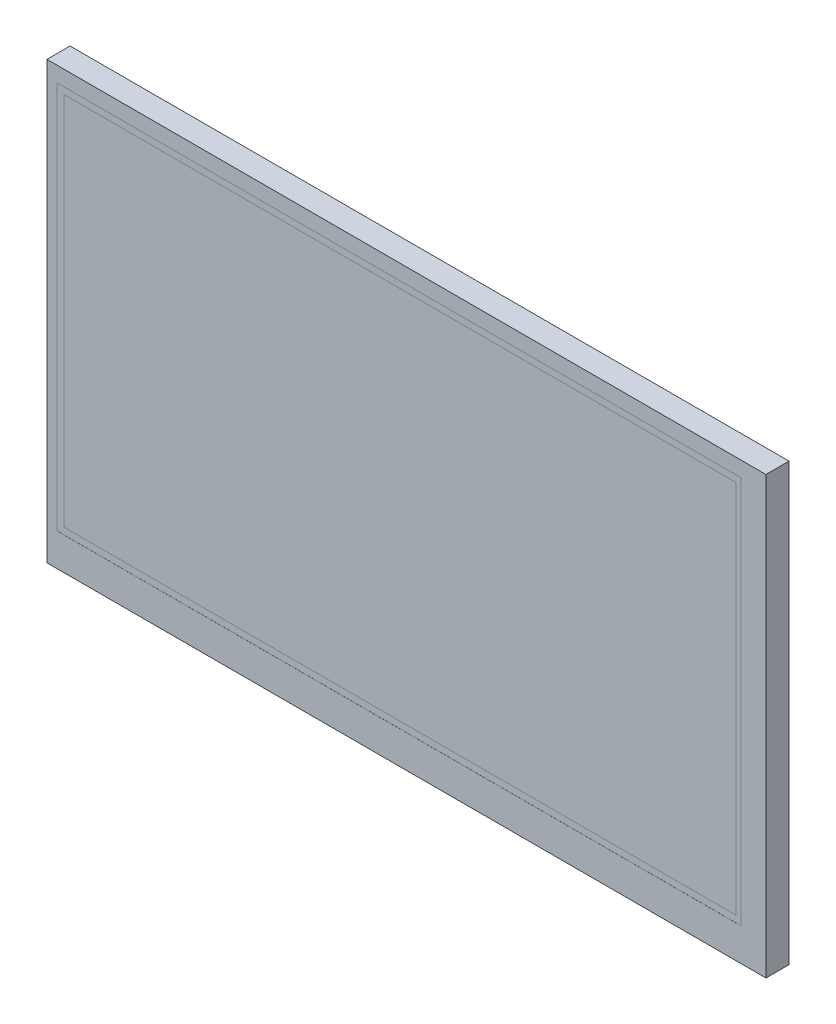
ISO-10303-21;
HEADER;
FILE_DESCRIPTION(('STEP AP214'),'2;1');
FILE_NAME('part.step','',(''),(''),'','','');
FILE_SCHEMA(('AUTOMOTIVE_DESIGN { 1 0 10303 214 1 1 1 1 }'));
ENDSEC;
DATA;
#1=APPLICATION_CONTEXT('core data for automotive mechanical design processes');
#2=APPLICATION_PROTOCOL_DEFINITION('international standard','automotive_design',2000,#1);
#3=PRODUCT_CONTEXT('',#1,'mechanical');
#4=PRODUCT('Part','Part','',(#3));
#5=PRODUCT_RELATED_PRODUCT_CATEGORY('part','',(#4));
#6=PRODUCT_DEFINITION_FORMATION('','',#4);
#7=PRODUCT_DEFINITION_CONTEXT('part definition',#1,'design');
#8=PRODUCT_DEFINITION('design','',#6,#7);
#9=PRODUCT_DEFINITION_SHAPE('','',#8);
#10=(LENGTH_UNIT() NAMED_UNIT(*) SI_UNIT(.MILLI.,.METRE.));
#11=(NAMED_UNIT(*) PLANE_ANGLE_UNIT() SI_UNIT($,.RADIAN.));
#12=(NAMED_UNIT(*) SI_UNIT($,.STERADIAN.) SOLID_ANGLE_UNIT());
#13=UNCERTAINTY_MEASURE_WITH_UNIT(LENGTH_MEASURE(1.E-05),#10,'distance_accuracy_value','');
#14=(GEOMETRIC_REPRESENTATION_CONTEXT(3) GLOBAL_UNCERTAINTY_ASSIGNED_CONTEXT((#13)) GLOBAL_UNIT_ASSIGNED_CONTEXT((#10,
#11,#12)) REPRESENTATION_CONTEXT('',''));
#15=CARTESIAN_POINT('',(0.,0.,0.));
#16=DIRECTION('',(0.,0.,1.));
#17=DIRECTION('',(1.,0.,0.));
#18=AXIS2_PLACEMENT_3D('',#15,#16,#17);
#19=CARTESIAN_POINT('',(0.,0.,5.29));
#20=DIRECTION('',(0.,0.,1.));
#21=DIRECTION('',(1.,0.,0.));
#22=AXIS2_PLACEMENT_3D('',#19,#20,#21);
#23=PLANE('',#22);
#24=DIRECTION('',(0.,-1.,0.));
#25=VECTOR('',#24,1.);
#26=CARTESIAN_POINT('',(-80.15,-42.5,5.29));
#27=LINE('',#26,#25);
#28=CARTESIAN_POINT('',(-80.15,46.5,5.29));
#29=VERTEX_POINT('',#28);
#30=CARTESIAN_POINT('',(-80.15,-42.5,5.29));
#31=VERTEX_POINT('',#30);
#32=EDGE_CURVE('E164',#29,#31,#27,.T.);
#33=ORIENTED_EDGE('',*,*,#32,.T.);
#34=DIRECTION('',(1.,0.,0.));
#35=VECTOR('',#34,1.);
#36=CARTESIAN_POINT('',(76.7500000000001,-42.5,5.29));
#37=LINE('',#36,#35);
#38=CARTESIAN_POINT('',(76.7500000000001,-42.5,5.29));
#39=VERTEX_POINT('',#38);
#40=EDGE_CURVE('E168',#31,#39,#37,.T.);
#41=ORIENTED_EDGE('',*,*,#40,.T.);
#42=DIRECTION('',(0.,1.,0.));
#43=VECTOR('',#42,1.);
#44=CARTESIAN_POINT('',(76.7500000000001,-42.5,5.29));
#45=LINE('',#44,#43);
#46=CARTESIAN_POINT('',(76.75,46.5,5.29));
#47=VERTEX_POINT('',#46);
#48=EDGE_CURVE('E173',#39,#47,#45,.T.);
#49=ORIENTED_EDGE('',*,*,#48,.T.);
#50=DIRECTION('',(-1.,0.,0.));
#51=VECTOR('',#50,1.);
#52=CARTESIAN_POINT('',(76.75,46.5,5.29));
#53=LINE('',#52,#51);
#54=EDGE_CURVE('E177',#47,#29,#53,.T.);
#55=ORIENTED_EDGE('',*,*,#54,.T.);
#56=EDGE_LOOP('',(#33,#41,#49,#55));
#57=FACE_BOUND('',#56,.T.);
#58=DIRECTION('',(-1.,0.,0.));
#59=VECTOR('',#58,1.);
#60=CARTESIAN_POINT('',(0.,-40.96,5.29));
#61=LINE('',#60,#59);
#62=CARTESIAN_POINT('',(75.5500000000001,-40.96,5.29));
#63=VERTEX_POINT('',#62);
#64=CARTESIAN_POINT('',(-78.53,-40.96,5.29));
#65=VERTEX_POINT('',#64);
#66=EDGE_CURVE('E61',#63,#65,#61,.T.);
#67=ORIENTED_EDGE('',*,*,#66,.T.);
#68=DIRECTION('',(0.,1.,0.));
#69=VECTOR('',#68,1.);
#70=CARTESIAN_POINT('',(-78.53,0.,5.29));
#71=LINE('',#70,#69);
#72=CARTESIAN_POINT('',(-78.53,44.96,5.29));
#73=VERTEX_POINT('',#72);
#74=EDGE_CURVE('E11',#65,#73,#71,.T.);
#75=ORIENTED_EDGE('',*,*,#74,.T.);
#76=DIRECTION('',(1.,0.,0.));
#77=VECTOR('',#76,1.);
#78=CARTESIAN_POINT('',(0.,44.96,5.29));
#79=LINE('',#78,#77);
#80=CARTESIAN_POINT('',(75.55,44.96,5.29));
#81=VERTEX_POINT('',#80);
#82=EDGE_CURVE('E221',#73,#81,#79,.T.);
#83=ORIENTED_EDGE('',*,*,#82,.T.);
#84=DIRECTION('',(0.,-1.,0.));
#85=VECTOR('',#84,1.);
#86=CARTESIAN_POINT('',(75.5500000000001,0.,5.29));
#87=LINE('',#86,#85);
#88=EDGE_CURVE('E225',#81,#63,#87,.T.);
#89=ORIENTED_EDGE('',*,*,#88,.T.);
#90=EDGE_LOOP('',(#67,#75,#83,#89));
#91=FACE_BOUND('',#90,.T.);
#92=ADVANCED_FACE('F52',(#57,#91),#23,.T.);
#93=CARTESIAN_POINT('',(-82.45,-50.,5.3));
#94=DIRECTION('',(1.,0.,0.));
#95=DIRECTION('',(0.,1.,0.));
#96=AXIS2_PLACEMENT_3D('',#93,#94,#95);
#97=PLANE('',#96);
#98=DIRECTION('',(0.,0.,-1.));
#99=VECTOR('',#98,1.);
#100=CARTESIAN_POINT('',(-82.45,50.,5.3));
#101=LINE('',#100,#99);
#102=CARTESIAN_POINT('',(-82.45,50.,5.3));
#103=VERTEX_POINT('',#102);
#104=CARTESIAN_POINT('',(-82.45,50.,0.));
#105=VERTEX_POINT('',#104);
#106=EDGE_CURVE('E68',#103,#105,#101,.T.);
#107=ORIENTED_EDGE('',*,*,#106,.T.);
#108=DIRECTION('',(0.,-1.,0.));
#109=VECTOR('',#108,1.);
#110=CARTESIAN_POINT('',(-82.45,50.,0.));
#111=LINE('',#110,#109);
#112=CARTESIAN_POINT('',(-82.45,-50.,0.));
#113=VERTEX_POINT('',#112);
#114=EDGE_CURVE('E151',#105,#113,#111,.T.);
#115=ORIENTED_EDGE('',*,*,#114,.T.);
#116=DIRECTION('',(0.,0.,-1.));
#117=VECTOR('',#116,1.);
#118=CARTESIAN_POINT('',(-82.45,-50.,5.3));
#119=LINE('',#118,#117);
#120=CARTESIAN_POINT('',(-82.45,-50.,5.3));
#121=VERTEX_POINT('',#120);
#122=EDGE_CURVE('E141',#121,#113,#119,.T.);
#123=ORIENTED_EDGE('',*,*,#122,.F.);
#124=DIRECTION('',(0.,-1.,0.));
#125=VECTOR('',#124,1.);
#126=CARTESIAN_POINT('',(-82.45,-50.,5.3));
#127=LINE('',#126,#125);
#128=EDGE_CURVE('E195',#103,#121,#127,.T.);
#129=ORIENTED_EDGE('',*,*,#128,.F.);
#130=EDGE_LOOP('',(#107,#115,#123,#129));
#131=FACE_BOUND('',#130,.T.);
#132=ADVANCED_FACE('F243',(#131),#97,.F.);
#133=CARTESIAN_POINT('',(82.45,-50.,5.3));
#134=DIRECTION('',(0.,1.,0.));
#135=DIRECTION('',(-1.,0.,0.));
#136=AXIS2_PLACEMENT_3D('',#133,#134,#135);
#137=PLANE('',#136);
#138=ORIENTED_EDGE('',*,*,#122,.T.);
#139=DIRECTION('',(1.,0.,0.));
#140=VECTOR('',#139,1.);
#141=CARTESIAN_POINT('',(-82.45,-50.,0.));
#142=LINE('',#141,#140);
#143=CARTESIAN_POINT('',(82.45,-50.,0.));
#144=VERTEX_POINT('',#143);
#145=EDGE_CURVE('E145',#113,#144,#142,.T.);
#146=ORIENTED_EDGE('',*,*,#145,.T.);
#147=DIRECTION('',(0.,0.,-1.));
#148=VECTOR('',#147,1.);
#149=CARTESIAN_POINT('',(82.45,-50.,5.3));
#150=LINE('',#149,#148);
#151=CARTESIAN_POINT('',(82.45,-50.,5.3));
#152=VERTEX_POINT('',#151);
#153=EDGE_CURVE('E131',#152,#144,#150,.T.);
#154=ORIENTED_EDGE('',*,*,#153,.F.);
#155=DIRECTION('',(1.,0.,0.));
#156=VECTOR('',#155,1.);
#157=CARTESIAN_POINT('',(82.45,-50.,5.3));
#158=LINE('',#157,#156);
#159=EDGE_CURVE('E208',#121,#152,#158,.T.);
#160=ORIENTED_EDGE('',*,*,#159,.F.);
#161=EDGE_LOOP('',(#138,#146,#154,#160));
#162=FACE_BOUND('',#161,.T.);
#163=ADVANCED_FACE('F146',(#162),#137,.F.);
#164=CARTESIAN_POINT('',(82.45,-50.,5.3));
#165=DIRECTION('',(-1.,0.,0.));
#166=DIRECTION('',(0.,-1.,0.));
#167=AXIS2_PLACEMENT_3D('',#164,#165,#166);
#168=PLANE('',#167);
#169=ORIENTED_EDGE('',*,*,#153,.T.);
#170=DIRECTION('',(0.,1.,0.));
#171=VECTOR('',#170,1.);
#172=CARTESIAN_POINT('',(82.45,-50.,0.));
#173=LINE('',#172,#171);
#174=CARTESIAN_POINT('',(82.45,50.,0.));
#175=VERTEX_POINT('',#174);
#176=EDGE_CURVE('E136',#144,#175,#173,.T.);
#177=ORIENTED_EDGE('',*,*,#176,.T.);
#178=DIRECTION('',(0.,0.,-1.));
#179=VECTOR('',#178,1.);
#180=CARTESIAN_POINT('',(82.45,50.,5.3));
#181=LINE('',#180,#179);
#182=CARTESIAN_POINT('',(82.45,50.,5.3));
#183=VERTEX_POINT('',#182);
#184=EDGE_CURVE('E142',#183,#175,#181,.T.);
#185=ORIENTED_EDGE('',*,*,#184,.F.);
#186=DIRECTION('',(0.,1.,0.));
#187=VECTOR('',#186,1.);
#188=CARTESIAN_POINT('',(82.45,-50.,5.3));
#189=LINE('',#188,#187);
#190=EDGE_CURVE('E138',#152,#183,#189,.T.);
#191=ORIENTED_EDGE('',*,*,#190,.F.);
#192=EDGE_LOOP('',(#169,#177,#185,#191));
#193=FACE_BOUND('',#192,.T.);
#194=ADVANCED_FACE('F133',(#193),#168,.F.);
#195=CARTESIAN_POINT('',(82.45,50.,5.3));
#196=DIRECTION('',(0.,-1.,0.));
#197=DIRECTION('',(1.,0.,0.));
#198=AXIS2_PLACEMENT_3D('',#195,#196,#197);
#199=PLANE('',#198);
#200=ORIENTED_EDGE('',*,*,#184,.T.);
#201=DIRECTION('',(-1.,0.,0.));
#202=VECTOR('',#201,1.);
#203=CARTESIAN_POINT('',(82.45,50.,0.));
#204=LINE('',#203,#202);
#205=EDGE_CURVE('E153',#175,#105,#204,.T.);
#206=ORIENTED_EDGE('',*,*,#205,.T.);
#207=ORIENTED_EDGE('',*,*,#106,.F.);
#208=DIRECTION('',(-1.,0.,0.));
#209=VECTOR('',#208,1.);
#210=CARTESIAN_POINT('',(82.45,50.,5.3));
#211=LINE('',#210,#209);
#212=EDGE_CURVE('E213',#183,#103,#211,.T.);
#213=ORIENTED_EDGE('',*,*,#212,.F.);
#214=EDGE_LOOP('',(#200,#206,#207,#213));
#215=FACE_BOUND('',#214,.T.);
#216=ADVANCED_FACE('F265',(#215),#199,.F.);
#217=CARTESIAN_POINT('',(0.,0.,5.3));
#218=DIRECTION('',(0.,0.,1.));
#219=DIRECTION('',(1.,0.,0.));
#220=AXIS2_PLACEMENT_3D('',#217,#218,#219);
#221=PLANE('',#220);
#222=DIRECTION('',(0.,-1.,0.));
#223=VECTOR('',#222,1.);
#224=CARTESIAN_POINT('',(-80.15,-42.5,5.3));
#225=LINE('',#224,#223);
#226=CARTESIAN_POINT('',(-80.15,46.5,5.3));
#227=VERTEX_POINT('',#226);
#228=CARTESIAN_POINT('',(-80.15,-42.5,5.3));
#229=VERTEX_POINT('',#228);
#230=EDGE_CURVE('E155',#227,#229,#225,.T.);
#231=ORIENTED_EDGE('',*,*,#230,.F.);
#232=DIRECTION('',(-1.,0.,0.));
#233=VECTOR('',#232,1.);
#234=CARTESIAN_POINT('',(76.75,46.5,5.3));
#235=LINE('',#234,#233);
#236=CARTESIAN_POINT('',(76.75,46.5,5.3));
#237=VERTEX_POINT('',#236);
#238=EDGE_CURVE('E169',#237,#227,#235,.T.);
#239=ORIENTED_EDGE('',*,*,#238,.F.);
#240=DIRECTION('',(0.,1.,0.));
#241=VECTOR('',#240,1.);
#242=CARTESIAN_POINT('',(76.7500000000001,-42.5,5.3));
#243=LINE('',#242,#241);
#244=CARTESIAN_POINT('',(76.7500000000001,-42.5,5.3));
#245=VERTEX_POINT('',#244);
#246=EDGE_CURVE('E185',#245,#237,#243,.T.);
#247=ORIENTED_EDGE('',*,*,#246,.F.);
#248=DIRECTION('',(1.,0.,0.));
#249=VECTOR('',#248,1.);
#250=CARTESIAN_POINT('',(76.7500000000001,-42.5,5.3));
#251=LINE('',#250,#249);
#252=EDGE_CURVE('E160',#229,#245,#251,.T.);
#253=ORIENTED_EDGE('',*,*,#252,.F.);
#254=EDGE_LOOP('',(#231,#239,#247,#253));
#255=FACE_BOUND('',#254,.T.);
#256=ORIENTED_EDGE('',*,*,#128,.T.);
#257=ORIENTED_EDGE('',*,*,#159,.T.);
#258=ORIENTED_EDGE('',*,*,#190,.T.);
#259=ORIENTED_EDGE('',*,*,#212,.T.);
#260=EDGE_LOOP('',(#256,#257,#258,#259));
#261=FACE_BOUND('',#260,.T.);
#262=ADVANCED_FACE('F262',(#255,#261),#221,.T.);
#263=CARTESIAN_POINT('',(-80.15,-42.5,5.29));
#264=DIRECTION('',(-1.,0.,0.));
#265=DIRECTION('',(0.,-1.,0.));
#266=AXIS2_PLACEMENT_3D('',#263,#264,#265);
#267=PLANE('',#266);
#268=ORIENTED_EDGE('',*,*,#230,.T.);
#269=DIRECTION('',(0.,0.,1.));
#270=VECTOR('',#269,1.);
#271=CARTESIAN_POINT('',(-80.15,-42.5,5.29));
#272=LINE('',#271,#270);
#273=EDGE_CURVE('E180',#31,#229,#272,.T.);
#274=ORIENTED_EDGE('',*,*,#273,.F.);
#275=ORIENTED_EDGE('',*,*,#32,.F.);
#276=DIRECTION('',(0.,0.,1.));
#277=VECTOR('',#276,1.);
#278=CARTESIAN_POINT('',(-80.15,46.5,5.29));
#279=LINE('',#278,#277);
#280=EDGE_CURVE('E192',#29,#227,#279,.T.);
#281=ORIENTED_EDGE('',*,*,#280,.T.);
#282=EDGE_LOOP('',(#268,#274,#275,#281));
#283=FACE_BOUND('',#282,.T.);
#284=ADVANCED_FACE('F252',(#283),#267,.F.);
#285=CARTESIAN_POINT('',(76.75,46.5,5.29));
#286=DIRECTION('',(0.,1.,0.));
#287=DIRECTION('',(-1.,0.,0.));
#288=AXIS2_PLACEMENT_3D('',#285,#286,#287);
#289=PLANE('',#288);
#290=ORIENTED_EDGE('',*,*,#238,.T.);
#291=ORIENTED_EDGE('',*,*,#280,.F.);
#292=ORIENTED_EDGE('',*,*,#54,.F.);
#293=DIRECTION('',(0.,0.,1.));
#294=VECTOR('',#293,1.);
#295=CARTESIAN_POINT('',(76.75,46.5,5.29));
#296=LINE('',#295,#294);
#297=EDGE_CURVE('E196',#47,#237,#296,.T.);
#298=ORIENTED_EDGE('',*,*,#297,.T.);
#299=EDGE_LOOP('',(#290,#291,#292,#298));
#300=FACE_BOUND('',#299,.T.);
#301=ADVANCED_FACE('F259',(#300),#289,.F.);
#302=CARTESIAN_POINT('',(76.7500000000001,-42.5,5.29));
#303=DIRECTION('',(1.,0.,0.));
#304=DIRECTION('',(0.,1.,0.));
#305=AXIS2_PLACEMENT_3D('',#302,#303,#304);
#306=PLANE('',#305);
#307=ORIENTED_EDGE('',*,*,#246,.T.);
#308=ORIENTED_EDGE('',*,*,#297,.F.);
#309=ORIENTED_EDGE('',*,*,#48,.F.);
#310=DIRECTION('',(0.,0.,1.));
#311=VECTOR('',#310,1.);
#312=CARTESIAN_POINT('',(76.7500000000001,-42.5,5.29));
#313=LINE('',#312,#311);
#314=EDGE_CURVE('E199',#39,#245,#313,.T.);
#315=ORIENTED_EDGE('',*,*,#314,.T.);
#316=EDGE_LOOP('',(#307,#308,#309,#315));
#317=FACE_BOUND('',#316,.T.);
#318=ADVANCED_FACE('F238',(#317),#306,.F.);
#319=CARTESIAN_POINT('',(76.7500000000001,-42.5,5.29));
#320=DIRECTION('',(0.,-1.,0.));
#321=DIRECTION('',(1.,0.,0.));
#322=AXIS2_PLACEMENT_3D('',#319,#320,#321);
#323=PLANE('',#322);
#324=ORIENTED_EDGE('',*,*,#252,.T.);
#325=ORIENTED_EDGE('',*,*,#314,.F.);
#326=ORIENTED_EDGE('',*,*,#40,.F.);
#327=ORIENTED_EDGE('',*,*,#273,.T.);
#328=EDGE_LOOP('',(#324,#325,#326,#327));
#329=FACE_BOUND('',#328,.T.);
#330=ADVANCED_FACE('F232',(#329),#323,.F.);
#331=ORIENTED_EDGE('',*,*,#74,.F.);
#332=ORIENTED_EDGE('',*,*,#66,.F.);
#333=ORIENTED_EDGE('',*,*,#88,.F.);
#334=ORIENTED_EDGE('',*,*,#82,.F.);
#335=EDGE_LOOP('',(#331,#332,#333,#334));
#336=FACE_BOUND('',#335,.T.);
#337=ADVANCED_FACE('F230',(#336),#23,.T.);
#338=CARTESIAN_POINT('',(0.,0.,0.));
#339=DIRECTION('',(0.,0.,1.));
#340=DIRECTION('',(1.,0.,0.));
#341=AXIS2_PLACEMENT_3D('',#338,#339,#340);
#342=PLANE('',#341);
#343=ORIENTED_EDGE('',*,*,#205,.F.);
#344=ORIENTED_EDGE('',*,*,#176,.F.);
#345=ORIENTED_EDGE('',*,*,#145,.F.);
#346=ORIENTED_EDGE('',*,*,#114,.F.);
#347=EDGE_LOOP('',(#343,#344,#345,#346));
#348=FACE_BOUND('',#347,.T.);
#349=ADVANCED_FACE('F54',(#348),#342,.F.);
#350=CLOSED_SHELL('',(#92,#132,#163,#194,#216,#262,#284,#301,#318,#330,#337,#349));
#351=MANIFOLD_SOLID_BREP('B2',#350);
#352=ADVANCED_BREP_SHAPE_REPRESENTATION('',(#18,#351),#14);
#353=SHAPE_DEFINITION_REPRESENTATION(#9,#352);
ENDSEC;
END-ISO-10303-21;
